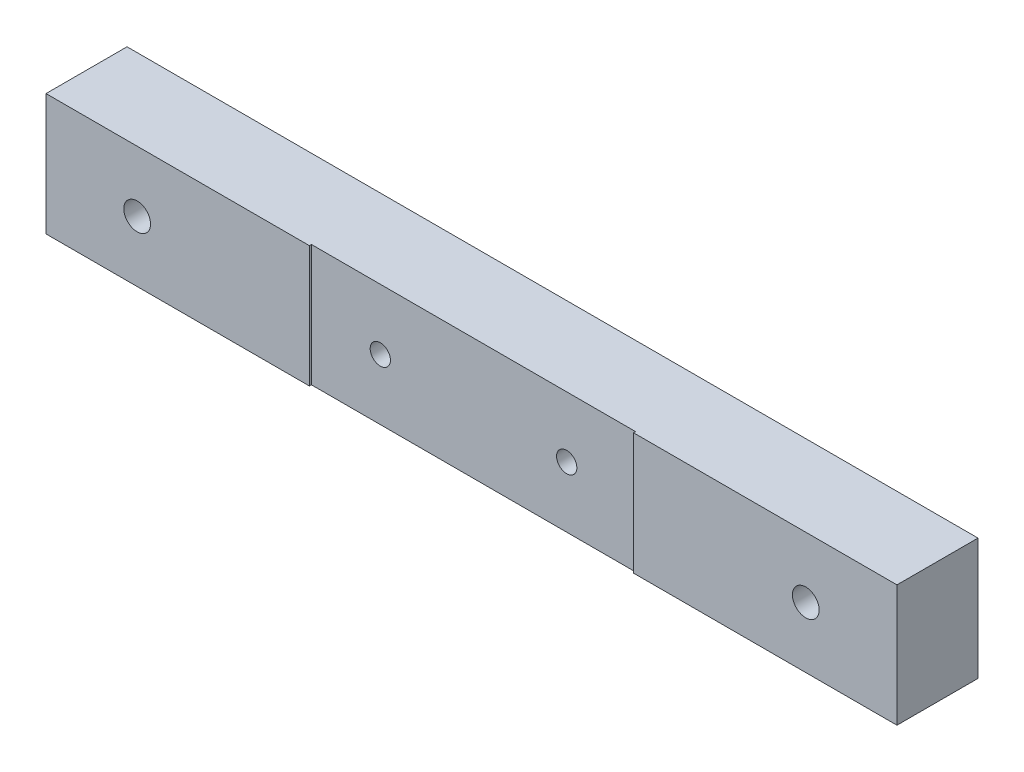
ISO-10303-21;
HEADER;
FILE_DESCRIPTION(('STEP AP214'),'2;1');
FILE_NAME('part.step','',(''),(''),'','','');
FILE_SCHEMA(('AUTOMOTIVE_DESIGN { 1 0 10303 214 1 1 1 1 }'));
ENDSEC;
DATA;
#1=APPLICATION_CONTEXT('core data for automotive mechanical design processes');
#2=APPLICATION_PROTOCOL_DEFINITION('international standard','automotive_design',2000,#1);
#3=PRODUCT_CONTEXT('',#1,'mechanical');
#4=PRODUCT('Part','Part','',(#3));
#5=PRODUCT_RELATED_PRODUCT_CATEGORY('part','',(#4));
#6=PRODUCT_DEFINITION_FORMATION('','',#4);
#7=PRODUCT_DEFINITION_CONTEXT('part definition',#1,'design');
#8=PRODUCT_DEFINITION('design','',#6,#7);
#9=PRODUCT_DEFINITION_SHAPE('','',#8);
#10=(LENGTH_UNIT() NAMED_UNIT(*) SI_UNIT(.MILLI.,.METRE.));
#11=(NAMED_UNIT(*) PLANE_ANGLE_UNIT() SI_UNIT($,.RADIAN.));
#12=(NAMED_UNIT(*) SI_UNIT($,.STERADIAN.) SOLID_ANGLE_UNIT());
#13=UNCERTAINTY_MEASURE_WITH_UNIT(LENGTH_MEASURE(1.E-05),#10,'distance_accuracy_value','');
#14=(GEOMETRIC_REPRESENTATION_CONTEXT(3) GLOBAL_UNCERTAINTY_ASSIGNED_CONTEXT((#13)) GLOBAL_UNIT_ASSIGNED_CONTEXT((#10,
#11,#12)) REPRESENTATION_CONTEXT('',''));
#15=CARTESIAN_POINT('',(0.,0.,0.));
#16=DIRECTION('',(0.,0.,1.));
#17=DIRECTION('',(1.,0.,0.));
#18=AXIS2_PLACEMENT_3D('',#15,#16,#17);
#19=CARTESIAN_POINT('',(0.,0.,20.));
#20=DIRECTION('',(0.,0.,1.));
#21=DIRECTION('',(1.,0.,0.));
#22=AXIS2_PLACEMENT_3D('',#19,#20,#21);
#23=PLANE('',#22);
#24=DIRECTION('',(0.,1.,0.));
#25=VECTOR('',#24,1.);
#26=CARTESIAN_POINT('',(-40.,-15.001,20.));
#27=LINE('',#26,#25);
#28=CARTESIAN_POINT('',(-40.,-15.,20.));
#29=VERTEX_POINT('',#28);
#30=CARTESIAN_POINT('',(-40.,15.,20.));
#31=VERTEX_POINT('',#30);
#32=EDGE_CURVE('E114',#29,#31,#27,.T.);
#33=ORIENTED_EDGE('',*,*,#32,.T.);
#34=DIRECTION('',(-1.,0.,0.));
#35=VECTOR('',#34,1.);
#36=CARTESIAN_POINT('',(-105.,15.,20.));
#37=LINE('',#36,#35);
#38=CARTESIAN_POINT('',(-105.,15.,20.));
#39=VERTEX_POINT('',#38);
#40=EDGE_CURVE('E207',#31,#39,#37,.T.);
#41=ORIENTED_EDGE('',*,*,#40,.T.);
#42=DIRECTION('',(0.,-1.,0.));
#43=VECTOR('',#42,1.);
#44=CARTESIAN_POINT('',(-105.,15.,20.));
#45=LINE('',#44,#43);
#46=CARTESIAN_POINT('',(-105.,-15.,20.));
#47=VERTEX_POINT('',#46);
#48=EDGE_CURVE('E135',#39,#47,#45,.T.);
#49=ORIENTED_EDGE('',*,*,#48,.T.);
#50=DIRECTION('',(1.,0.,0.));
#51=VECTOR('',#50,1.);
#52=CARTESIAN_POINT('',(-105.,-15.,20.));
#53=LINE('',#52,#51);
#54=EDGE_CURVE('E129',#47,#29,#53,.T.);
#55=ORIENTED_EDGE('',*,*,#54,.T.);
#56=EDGE_LOOP('',(#33,#41,#49,#55));
#57=FACE_BOUND('',#56,.T.);
#58=CARTESIAN_POINT('',(-82.5,0.,20.));
#59=DIRECTION('',(0.,0.,-1.));
#60=DIRECTION('',(-1.,0.,0.));
#61=AXIS2_PLACEMENT_3D('',#58,#59,#60);
#62=CIRCLE('',#61,3.3);
#63=CARTESIAN_POINT('',(-85.8,0.,20.));
#64=VERTEX_POINT('',#63);
#65=EDGE_CURVE('E193',#64,#64,#62,.T.);
#66=ORIENTED_EDGE('',*,*,#65,.T.);
#67=EDGE_LOOP('',(#66));
#68=FACE_BOUND('',#67,.T.);
#69=ADVANCED_FACE('F39',(#57,#68),#23,.T.);
#70=CARTESIAN_POINT('',(105.,15.,20.));
#71=DIRECTION('',(-1.,0.,0.));
#72=DIRECTION('',(0.,-1.,0.));
#73=AXIS2_PLACEMENT_3D('',#70,#71,#72);
#74=PLANE('',#73);
#75=DIRECTION('',(0.,1.,0.));
#76=VECTOR('',#75,1.);
#77=CARTESIAN_POINT('',(105.,15.,0.));
#78=LINE('',#77,#76);
#79=CARTESIAN_POINT('',(105.,-15.,0.));
#80=VERTEX_POINT('',#79);
#81=CARTESIAN_POINT('',(105.,15.,0.));
#82=VERTEX_POINT('',#81);
#83=EDGE_CURVE('E144',#80,#82,#78,.T.);
#84=ORIENTED_EDGE('',*,*,#83,.T.);
#85=DIRECTION('',(0.,0.,-1.));
#86=VECTOR('',#85,1.);
#87=CARTESIAN_POINT('',(105.,15.,20.));
#88=LINE('',#87,#86);
#89=CARTESIAN_POINT('',(105.,15.,20.));
#90=VERTEX_POINT('',#89);
#91=EDGE_CURVE('E11',#90,#82,#88,.T.);
#92=ORIENTED_EDGE('',*,*,#91,.F.);
#93=DIRECTION('',(0.,1.,0.));
#94=VECTOR('',#93,1.);
#95=CARTESIAN_POINT('',(105.,15.,20.));
#96=LINE('',#95,#94);
#97=CARTESIAN_POINT('',(105.,-15.,20.));
#98=VERTEX_POINT('',#97);
#99=EDGE_CURVE('E152',#98,#90,#96,.T.);
#100=ORIENTED_EDGE('',*,*,#99,.F.);
#101=DIRECTION('',(0.,0.,-1.));
#102=VECTOR('',#101,1.);
#103=CARTESIAN_POINT('',(105.,-15.,20.));
#104=LINE('',#103,#102);
#105=EDGE_CURVE('E137',#98,#80,#104,.T.);
#106=ORIENTED_EDGE('',*,*,#105,.T.);
#107=EDGE_LOOP('',(#84,#92,#100,#106));
#108=FACE_BOUND('',#107,.T.);
#109=ADVANCED_FACE('F41',(#108),#74,.F.);
#110=CARTESIAN_POINT('',(-105.,15.,20.));
#111=DIRECTION('',(0.,-1.,0.));
#112=DIRECTION('',(1.,0.,0.));
#113=AXIS2_PLACEMENT_3D('',#110,#111,#112);
#114=PLANE('',#113);
#115=ORIENTED_EDGE('',*,*,#40,.F.);
#116=DIRECTION('',(0.,0.,1.));
#117=VECTOR('',#116,1.);
#118=CARTESIAN_POINT('',(-40.,15.,19.5));
#119=LINE('',#118,#117);
#120=CARTESIAN_POINT('',(-40.,15.,19.5));
#121=VERTEX_POINT('',#120);
#122=EDGE_CURVE('E120',#121,#31,#119,.T.);
#123=ORIENTED_EDGE('',*,*,#122,.F.);
#124=DIRECTION('',(-1.,0.,0.));
#125=VECTOR('',#124,1.);
#126=CARTESIAN_POINT('',(-40.,15.,19.5));
#127=LINE('',#126,#125);
#128=CARTESIAN_POINT('',(40.,15.,19.5));
#129=VERTEX_POINT('',#128);
#130=EDGE_CURVE('E125',#129,#121,#127,.T.);
#131=ORIENTED_EDGE('',*,*,#130,.F.);
#132=DIRECTION('',(0.,0.,-1.));
#133=VECTOR('',#132,1.);
#134=CARTESIAN_POINT('',(40.,15.,19.5));
#135=LINE('',#134,#133);
#136=CARTESIAN_POINT('',(40.,15.,20.));
#137=VERTEX_POINT('',#136);
#138=EDGE_CURVE('E174',#137,#129,#135,.T.);
#139=ORIENTED_EDGE('',*,*,#138,.F.);
#140=EDGE_CURVE('E91',#90,#137,#37,.T.);
#141=ORIENTED_EDGE('',*,*,#140,.F.);
#142=ORIENTED_EDGE('',*,*,#91,.T.);
#143=DIRECTION('',(-1.,0.,0.));
#144=VECTOR('',#143,1.);
#145=CARTESIAN_POINT('',(-105.,15.,0.));
#146=LINE('',#145,#144);
#147=CARTESIAN_POINT('',(-105.,15.,0.));
#148=VERTEX_POINT('',#147);
#149=EDGE_CURVE('E147',#82,#148,#146,.T.);
#150=ORIENTED_EDGE('',*,*,#149,.T.);
#151=DIRECTION('',(0.,0.,-1.));
#152=VECTOR('',#151,1.);
#153=CARTESIAN_POINT('',(-105.,15.,20.));
#154=LINE('',#153,#152);
#155=EDGE_CURVE('E47',#39,#148,#154,.T.);
#156=ORIENTED_EDGE('',*,*,#155,.F.);
#157=EDGE_LOOP('',(#115,#123,#131,#139,#141,#142,#150,#156));
#158=FACE_BOUND('',#157,.T.);
#159=ADVANCED_FACE('F208',(#158),#114,.F.);
#160=CARTESIAN_POINT('',(-105.,15.,20.));
#161=DIRECTION('',(1.,0.,0.));
#162=DIRECTION('',(0.,0.,-1.));
#163=AXIS2_PLACEMENT_3D('',#160,#161,#162);
#164=PLANE('',#163);
#165=DIRECTION('',(0.,-1.,0.));
#166=VECTOR('',#165,1.);
#167=CARTESIAN_POINT('',(-105.,15.,0.));
#168=LINE('',#167,#166);
#169=CARTESIAN_POINT('',(-105.,-15.,0.));
#170=VERTEX_POINT('',#169);
#171=EDGE_CURVE('E150',#148,#170,#168,.T.);
#172=ORIENTED_EDGE('',*,*,#171,.T.);
#173=DIRECTION('',(0.,0.,-1.));
#174=VECTOR('',#173,1.);
#175=CARTESIAN_POINT('',(-105.,-15.,20.));
#176=LINE('',#175,#174);
#177=EDGE_CURVE('E139',#47,#170,#176,.T.);
#178=ORIENTED_EDGE('',*,*,#177,.F.);
#179=ORIENTED_EDGE('',*,*,#48,.F.);
#180=ORIENTED_EDGE('',*,*,#155,.T.);
#181=EDGE_LOOP('',(#172,#178,#179,#180));
#182=FACE_BOUND('',#181,.T.);
#183=ADVANCED_FACE('F158',(#182),#164,.F.);
#184=CARTESIAN_POINT('',(-105.,-15.,20.));
#185=DIRECTION('',(0.,1.,0.));
#186=DIRECTION('',(0.,0.,1.));
#187=AXIS2_PLACEMENT_3D('',#184,#185,#186);
#188=PLANE('',#187);
#189=DIRECTION('',(1.,0.,0.));
#190=VECTOR('',#189,1.);
#191=CARTESIAN_POINT('',(-40.,-15.,19.5));
#192=LINE('',#191,#190);
#193=CARTESIAN_POINT('',(-40.,-15.,19.5));
#194=VERTEX_POINT('',#193);
#195=CARTESIAN_POINT('',(40.,-15.,19.5));
#196=VERTEX_POINT('',#195);
#197=EDGE_CURVE('E131',#194,#196,#192,.T.);
#198=ORIENTED_EDGE('',*,*,#197,.F.);
#199=DIRECTION('',(0.,0.,-1.));
#200=VECTOR('',#199,1.);
#201=CARTESIAN_POINT('',(-40.,-15.,19.5));
#202=LINE('',#201,#200);
#203=EDGE_CURVE('E117',#29,#194,#202,.T.);
#204=ORIENTED_EDGE('',*,*,#203,.F.);
#205=ORIENTED_EDGE('',*,*,#54,.F.);
#206=ORIENTED_EDGE('',*,*,#177,.T.);
#207=DIRECTION('',(1.,0.,0.));
#208=VECTOR('',#207,1.);
#209=CARTESIAN_POINT('',(-105.,-15.,0.));
#210=LINE('',#209,#208);
#211=EDGE_CURVE('E84',#170,#80,#210,.T.);
#212=ORIENTED_EDGE('',*,*,#211,.T.);
#213=ORIENTED_EDGE('',*,*,#105,.F.);
#214=CARTESIAN_POINT('',(40.,-15.,20.));
#215=VERTEX_POINT('',#214);
#216=EDGE_CURVE('E62',#215,#98,#53,.T.);
#217=ORIENTED_EDGE('',*,*,#216,.F.);
#218=DIRECTION('',(0.,0.,1.));
#219=VECTOR('',#218,1.);
#220=CARTESIAN_POINT('',(40.,-15.,19.5));
#221=LINE('',#220,#219);
#222=EDGE_CURVE('E54',#196,#215,#221,.T.);
#223=ORIENTED_EDGE('',*,*,#222,.F.);
#224=EDGE_LOOP('',(#198,#204,#205,#206,#212,#213,#217,#223));
#225=FACE_BOUND('',#224,.T.);
#226=ADVANCED_FACE('F128',(#225),#188,.F.);
#227=DIRECTION('',(0.,1.,0.));
#228=VECTOR('',#227,1.);
#229=CARTESIAN_POINT('',(40.,-15.001,20.));
#230=LINE('',#229,#228);
#231=EDGE_CURVE('E124',#215,#137,#230,.T.);
#232=ORIENTED_EDGE('',*,*,#231,.F.);
#233=ORIENTED_EDGE('',*,*,#216,.T.);
#234=ORIENTED_EDGE('',*,*,#99,.T.);
#235=ORIENTED_EDGE('',*,*,#140,.T.);
#236=EDGE_LOOP('',(#232,#233,#234,#235));
#237=FACE_BOUND('',#236,.T.);
#238=CARTESIAN_POINT('',(82.5,0.,20.));
#239=DIRECTION('',(0.,0.,-1.));
#240=DIRECTION('',(-1.,0.,0.));
#241=AXIS2_PLACEMENT_3D('',#238,#239,#240);
#242=CIRCLE('',#241,3.3);
#243=CARTESIAN_POINT('',(79.2,0.,20.));
#244=VERTEX_POINT('',#243);
#245=EDGE_CURVE('E148',#244,#244,#242,.T.);
#246=ORIENTED_EDGE('',*,*,#245,.T.);
#247=EDGE_LOOP('',(#246));
#248=FACE_BOUND('',#247,.T.);
#249=ADVANCED_FACE('F213',(#237,#248),#23,.T.);
#250=CARTESIAN_POINT('',(0.,0.,0.));
#251=DIRECTION('',(0.,0.,1.));
#252=DIRECTION('',(1.,0.,0.));
#253=AXIS2_PLACEMENT_3D('',#250,#251,#252);
#254=PLANE('',#253);
#255=CARTESIAN_POINT('',(-22.9999999999999,-3.40005801291454E-13,0.));
#256=DIRECTION('',(0.,0.,1.));
#257=DIRECTION('',(1.,0.,0.));
#258=AXIS2_PLACEMENT_3D('',#255,#256,#257);
#259=CIRCLE('',#258,2.5);
#260=CARTESIAN_POINT('',(-20.4999999999999,-3.40005801291454E-13,0.));
#261=VERTEX_POINT('',#260);
#262=EDGE_CURVE('E280',#261,#261,#259,.T.);
#263=ORIENTED_EDGE('',*,*,#262,.T.);
#264=EDGE_LOOP('',(#263));
#265=FACE_BOUND('',#264,.T.);
#266=CARTESIAN_POINT('',(23.0000000000001,-4.49293380277993E-13,0.));
#267=DIRECTION('',(0.,0.,1.));
#268=DIRECTION('',(1.,0.,0.));
#269=AXIS2_PLACEMENT_3D('',#266,#267,#268);
#270=CIRCLE('',#269,2.5);
#271=CARTESIAN_POINT('',(25.5,-4.49293380277993E-13,0.));
#272=VERTEX_POINT('',#271);
#273=EDGE_CURVE('E165',#272,#272,#270,.T.);
#274=ORIENTED_EDGE('',*,*,#273,.T.);
#275=EDGE_LOOP('',(#274));
#276=FACE_BOUND('',#275,.T.);
#277=CARTESIAN_POINT('',(-82.5,0.,0.));
#278=DIRECTION('',(0.,0.,-1.));
#279=DIRECTION('',(-1.,0.,0.));
#280=AXIS2_PLACEMENT_3D('',#277,#278,#279);
#281=CIRCLE('',#280,7.99999999999999);
#282=CARTESIAN_POINT('',(-90.5,0.,0.));
#283=VERTEX_POINT('',#282);
#284=EDGE_CURVE('E181',#283,#283,#281,.T.);
#285=ORIENTED_EDGE('',*,*,#284,.F.);
#286=EDGE_LOOP('',(#285));
#287=FACE_BOUND('',#286,.T.);
#288=CARTESIAN_POINT('',(82.5,0.,0.));
#289=DIRECTION('',(0.,0.,-1.));
#290=DIRECTION('',(-1.,0.,0.));
#291=AXIS2_PLACEMENT_3D('',#288,#289,#290);
#292=CIRCLE('',#291,7.99999999999999);
#293=CARTESIAN_POINT('',(74.5,0.,0.));
#294=VERTEX_POINT('',#293);
#295=EDGE_CURVE('E196',#294,#294,#292,.T.);
#296=ORIENTED_EDGE('',*,*,#295,.F.);
#297=EDGE_LOOP('',(#296));
#298=FACE_BOUND('',#297,.T.);
#299=ORIENTED_EDGE('',*,*,#83,.F.);
#300=ORIENTED_EDGE('',*,*,#211,.F.);
#301=ORIENTED_EDGE('',*,*,#171,.F.);
#302=ORIENTED_EDGE('',*,*,#149,.F.);
#303=EDGE_LOOP('',(#299,#300,#301,#302));
#304=FACE_BOUND('',#303,.T.);
#305=ADVANCED_FACE('F161',(#265,#276,#287,#298,#304),#254,.F.);
#306=CARTESIAN_POINT('',(82.5,0.,0.));
#307=DIRECTION('',(0.,0.,-1.));
#308=DIRECTION('',(-1.,0.,0.));
#309=AXIS2_PLACEMENT_3D('',#306,#307,#308);
#310=CYLINDRICAL_SURFACE('',#309,3.3);
#311=ORIENTED_EDGE('',*,*,#245,.F.);
#312=EDGE_LOOP('',(#311));
#313=FACE_BOUND('',#312,.T.);
#314=CARTESIAN_POINT('',(82.5,0.,6.6));
#315=DIRECTION('',(0.,0.,-1.));
#316=DIRECTION('',(-1.,0.,0.));
#317=AXIS2_PLACEMENT_3D('',#314,#315,#316);
#318=CIRCLE('',#317,3.30000000000001);
#319=CARTESIAN_POINT('',(79.2,0.,6.6));
#320=VERTEX_POINT('',#319);
#321=EDGE_CURVE('E202',#320,#320,#318,.T.);
#322=ORIENTED_EDGE('',*,*,#321,.T.);
#323=EDGE_LOOP('',(#322));
#324=FACE_BOUND('',#323,.T.);
#325=ADVANCED_FACE('F219',(#313,#324),#310,.F.);
#326=CARTESIAN_POINT('',(85.8,0.,6.6));
#327=DIRECTION('',(0.,0.,1.));
#328=DIRECTION('',(1.,0.,0.));
#329=AXIS2_PLACEMENT_3D('',#326,#327,#328);
#330=PLANE('',#329);
#331=ORIENTED_EDGE('',*,*,#321,.F.);
#332=EDGE_LOOP('',(#331));
#333=FACE_BOUND('',#332,.T.);
#334=CARTESIAN_POINT('',(82.5,0.,6.6));
#335=DIRECTION('',(0.,0.,-1.));
#336=DIRECTION('',(-1.,0.,0.));
#337=AXIS2_PLACEMENT_3D('',#334,#335,#336);
#338=CIRCLE('',#337,7.99999999999999);
#339=CARTESIAN_POINT('',(74.5,0.,6.6));
#340=VERTEX_POINT('',#339);
#341=EDGE_CURVE('E199',#340,#340,#338,.T.);
#342=ORIENTED_EDGE('',*,*,#341,.T.);
#343=EDGE_LOOP('',(#342));
#344=FACE_BOUND('',#343,.T.);
#345=ADVANCED_FACE('F222',(#333,#344),#330,.F.);
#346=CARTESIAN_POINT('',(82.5,0.,0.));
#347=DIRECTION('',(0.,0.,-1.));
#348=DIRECTION('',(-1.,0.,0.));
#349=AXIS2_PLACEMENT_3D('',#346,#347,#348);
#350=CYLINDRICAL_SURFACE('',#349,7.99999999999999);
#351=ORIENTED_EDGE('',*,*,#341,.F.);
#352=EDGE_LOOP('',(#351));
#353=FACE_BOUND('',#352,.T.);
#354=ORIENTED_EDGE('',*,*,#295,.T.);
#355=EDGE_LOOP('',(#354));
#356=FACE_BOUND('',#355,.T.);
#357=ADVANCED_FACE('F228',(#353,#356),#350,.F.);
#358=CARTESIAN_POINT('',(-82.5,0.,0.));
#359=DIRECTION('',(0.,0.,-1.));
#360=DIRECTION('',(-1.,0.,0.));
#361=AXIS2_PLACEMENT_3D('',#358,#359,#360);
#362=CYLINDRICAL_SURFACE('',#361,3.3);
#363=ORIENTED_EDGE('',*,*,#65,.F.);
#364=EDGE_LOOP('',(#363));
#365=FACE_BOUND('',#364,.T.);
#366=CARTESIAN_POINT('',(-82.5,0.,6.6));
#367=DIRECTION('',(0.,0.,-1.));
#368=DIRECTION('',(-1.,0.,0.));
#369=AXIS2_PLACEMENT_3D('',#366,#367,#368);
#370=CIRCLE('',#369,3.30000000000001);
#371=CARTESIAN_POINT('',(-85.8,0.,6.6));
#372=VERTEX_POINT('',#371);
#373=EDGE_CURVE('E190',#372,#372,#370,.T.);
#374=ORIENTED_EDGE('',*,*,#373,.T.);
#375=EDGE_LOOP('',(#374));
#376=FACE_BOUND('',#375,.T.);
#377=ADVANCED_FACE('F234',(#365,#376),#362,.F.);
#378=CARTESIAN_POINT('',(-79.2,0.,6.6));
#379=DIRECTION('',(0.,0.,1.));
#380=DIRECTION('',(1.,0.,0.));
#381=AXIS2_PLACEMENT_3D('',#378,#379,#380);
#382=PLANE('',#381);
#383=ORIENTED_EDGE('',*,*,#373,.F.);
#384=EDGE_LOOP('',(#383));
#385=FACE_BOUND('',#384,.T.);
#386=CARTESIAN_POINT('',(-82.5,0.,6.6));
#387=DIRECTION('',(0.,0.,-1.));
#388=DIRECTION('',(-1.,0.,0.));
#389=AXIS2_PLACEMENT_3D('',#386,#387,#388);
#390=CIRCLE('',#389,7.99999999999999);
#391=CARTESIAN_POINT('',(-90.5,0.,6.6));
#392=VERTEX_POINT('',#391);
#393=EDGE_CURVE('E187',#392,#392,#390,.T.);
#394=ORIENTED_EDGE('',*,*,#393,.T.);
#395=EDGE_LOOP('',(#394));
#396=FACE_BOUND('',#395,.T.);
#397=ADVANCED_FACE('F253',(#385,#396),#382,.F.);
#398=CARTESIAN_POINT('',(-82.5,0.,0.));
#399=DIRECTION('',(0.,0.,-1.));
#400=DIRECTION('',(-1.,0.,0.));
#401=AXIS2_PLACEMENT_3D('',#398,#399,#400);
#402=CYLINDRICAL_SURFACE('',#401,7.99999999999999);
#403=ORIENTED_EDGE('',*,*,#393,.F.);
#404=EDGE_LOOP('',(#403));
#405=FACE_BOUND('',#404,.T.);
#406=ORIENTED_EDGE('',*,*,#284,.T.);
#407=EDGE_LOOP('',(#406));
#408=FACE_BOUND('',#407,.T.);
#409=ADVANCED_FACE('F257',(#405,#408),#402,.F.);
#410=CARTESIAN_POINT('',(-40.,-15.001,19.5));
#411=DIRECTION('',(-1.,0.,0.));
#412=DIRECTION('',(0.,-1.,0.));
#413=AXIS2_PLACEMENT_3D('',#410,#411,#412);
#414=PLANE('',#413);
#415=ORIENTED_EDGE('',*,*,#203,.T.);
#416=DIRECTION('',(0.,1.,0.));
#417=VECTOR('',#416,1.);
#418=CARTESIAN_POINT('',(-40.,-15.001,19.5));
#419=LINE('',#418,#417);
#420=EDGE_CURVE('E179',#194,#121,#419,.T.);
#421=ORIENTED_EDGE('',*,*,#420,.T.);
#422=ORIENTED_EDGE('',*,*,#122,.T.);
#423=ORIENTED_EDGE('',*,*,#32,.F.);
#424=EDGE_LOOP('',(#415,#421,#422,#423));
#425=FACE_BOUND('',#424,.T.);
#426=ADVANCED_FACE('F116',(#425),#414,.F.);
#427=CARTESIAN_POINT('',(-40.,-15.001,19.5));
#428=DIRECTION('',(0.,0.,-1.));
#429=DIRECTION('',(-1.,0.,0.));
#430=AXIS2_PLACEMENT_3D('',#427,#428,#429);
#431=PLANE('',#430);
#432=CARTESIAN_POINT('',(-22.9999999999999,-3.40005801291454E-13,19.5));
#433=DIRECTION('',(0.,0.,1.));
#434=DIRECTION('',(1.,0.,0.));
#435=AXIS2_PLACEMENT_3D('',#432,#433,#434);
#436=CIRCLE('',#435,2.49999999999999);
#437=CARTESIAN_POINT('',(-20.5,-3.40005801291454E-13,19.5));
#438=VERTEX_POINT('',#437);
#439=EDGE_CURVE('E283',#438,#438,#436,.T.);
#440=ORIENTED_EDGE('',*,*,#439,.F.);
#441=EDGE_LOOP('',(#440));
#442=FACE_BOUND('',#441,.T.);
#443=CARTESIAN_POINT('',(23.0000000000001,-4.49293380277993E-13,19.5));
#444=DIRECTION('',(0.,0.,1.));
#445=DIRECTION('',(1.,0.,0.));
#446=AXIS2_PLACEMENT_3D('',#443,#444,#445);
#447=CIRCLE('',#446,2.49999999999999);
#448=CARTESIAN_POINT('',(25.5,-4.49293380277993E-13,19.5));
#449=VERTEX_POINT('',#448);
#450=EDGE_CURVE('E169',#449,#449,#447,.T.);
#451=ORIENTED_EDGE('',*,*,#450,.F.);
#452=EDGE_LOOP('',(#451));
#453=FACE_BOUND('',#452,.T.);
#454=ORIENTED_EDGE('',*,*,#197,.T.);
#455=DIRECTION('',(0.,1.,0.));
#456=VECTOR('',#455,1.);
#457=CARTESIAN_POINT('',(40.,-15.001,19.5));
#458=LINE('',#457,#456);
#459=EDGE_CURVE('E182',#196,#129,#458,.T.);
#460=ORIENTED_EDGE('',*,*,#459,.T.);
#461=ORIENTED_EDGE('',*,*,#130,.T.);
#462=ORIENTED_EDGE('',*,*,#420,.F.);
#463=EDGE_LOOP('',(#454,#460,#461,#462));
#464=FACE_BOUND('',#463,.T.);
#465=ADVANCED_FACE('F211',(#442,#453,#464),#431,.F.);
#466=CARTESIAN_POINT('',(40.,-15.001,19.5));
#467=DIRECTION('',(1.,0.,0.));
#468=DIRECTION('',(0.,0.,-1.));
#469=AXIS2_PLACEMENT_3D('',#466,#467,#468);
#470=PLANE('',#469);
#471=ORIENTED_EDGE('',*,*,#222,.T.);
#472=ORIENTED_EDGE('',*,*,#231,.T.);
#473=ORIENTED_EDGE('',*,*,#138,.T.);
#474=ORIENTED_EDGE('',*,*,#459,.F.);
#475=EDGE_LOOP('',(#471,#472,#473,#474));
#476=FACE_BOUND('',#475,.T.);
#477=ADVANCED_FACE('F212',(#476),#470,.F.);
#478=CARTESIAN_POINT('',(23.0000000000001,-4.49293380277993E-13,19.5));
#479=DIRECTION('',(0.,0.,1.));
#480=DIRECTION('',(1.,0.,0.));
#481=AXIS2_PLACEMENT_3D('',#478,#479,#480);
#482=CYLINDRICAL_SURFACE('',#481,2.49999999999999);
#483=ORIENTED_EDGE('',*,*,#273,.F.);
#484=EDGE_LOOP('',(#483));
#485=FACE_BOUND('',#484,.T.);
#486=ORIENTED_EDGE('',*,*,#450,.T.);
#487=EDGE_LOOP('',(#486));
#488=FACE_BOUND('',#487,.T.);
#489=ADVANCED_FACE('F266',(#485,#488),#482,.F.);
#490=CARTESIAN_POINT('',(-22.9999999999999,-3.40005801291454E-13,19.5));
#491=DIRECTION('',(0.,0.,1.));
#492=DIRECTION('',(1.,0.,0.));
#493=AXIS2_PLACEMENT_3D('',#490,#491,#492);
#494=CYLINDRICAL_SURFACE('',#493,2.49999999999999);
#495=ORIENTED_EDGE('',*,*,#262,.F.);
#496=EDGE_LOOP('',(#495));
#497=FACE_BOUND('',#496,.T.);
#498=ORIENTED_EDGE('',*,*,#439,.T.);
#499=EDGE_LOOP('',(#498));
#500=FACE_BOUND('',#499,.T.);
#501=ADVANCED_FACE('F272',(#497,#500),#494,.F.);
#502=CLOSED_SHELL('',(#69,#109,#159,#183,#226,#249,#305,#325,#345,#357,#377,#397,#409,#426,#465,
#477,#489,#501));
#503=MANIFOLD_SOLID_BREP('B2',#502);
#504=ADVANCED_BREP_SHAPE_REPRESENTATION('',(#18,#503),#14);
#505=SHAPE_DEFINITION_REPRESENTATION(#9,#504);
ENDSEC;
END-ISO-10303-21;
